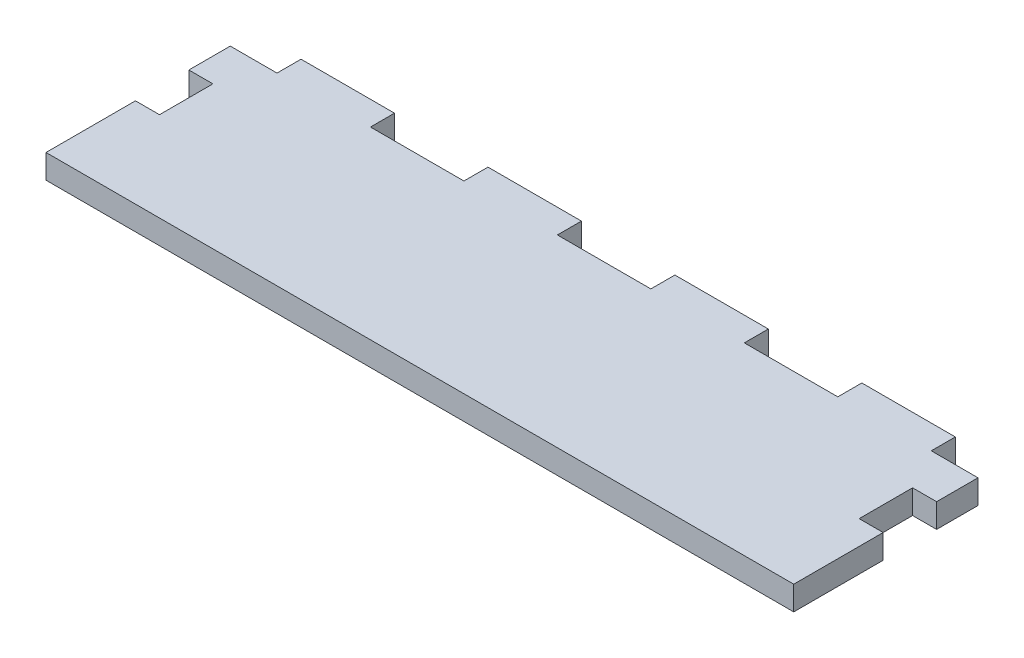
ISO-10303-21;
HEADER;
FILE_DESCRIPTION(('STEP AP214'),'2;1');
FILE_NAME('part.step','',(''),(''),'','','');
FILE_SCHEMA(('AUTOMOTIVE_DESIGN { 1 0 10303 214 1 1 1 1 }'));
ENDSEC;
DATA;
#1=APPLICATION_CONTEXT('core data for automotive mechanical design processes');
#2=APPLICATION_PROTOCOL_DEFINITION('international standard','automotive_design',2000,#1);
#3=PRODUCT_CONTEXT('',#1,'mechanical');
#4=PRODUCT('Part','Part','',(#3));
#5=PRODUCT_RELATED_PRODUCT_CATEGORY('part','',(#4));
#6=PRODUCT_DEFINITION_FORMATION('','',#4);
#7=PRODUCT_DEFINITION_CONTEXT('part definition',#1,'design');
#8=PRODUCT_DEFINITION('design','',#6,#7);
#9=PRODUCT_DEFINITION_SHAPE('','',#8);
#10=(LENGTH_UNIT() NAMED_UNIT(*) SI_UNIT(.MILLI.,.METRE.));
#11=(NAMED_UNIT(*) PLANE_ANGLE_UNIT() SI_UNIT($,.RADIAN.));
#12=(NAMED_UNIT(*) SI_UNIT($,.STERADIAN.) SOLID_ANGLE_UNIT());
#13=UNCERTAINTY_MEASURE_WITH_UNIT(LENGTH_MEASURE(1.E-05),#10,'distance_accuracy_value','');
#14=(GEOMETRIC_REPRESENTATION_CONTEXT(3) GLOBAL_UNCERTAINTY_ASSIGNED_CONTEXT((#13)) GLOBAL_UNIT_ASSIGNED_CONTEXT((#10,
#11,#12)) REPRESENTATION_CONTEXT('',''));
#15=CARTESIAN_POINT('',(0.,0.,0.));
#16=DIRECTION('',(0.,0.,1.));
#17=DIRECTION('',(1.,0.,0.));
#18=AXIS2_PLACEMENT_3D('',#15,#16,#17);
#19=CARTESIAN_POINT('',(140.,0.,349.144605516508));
#20=DIRECTION('',(-1.,0.,0.));
#21=DIRECTION('',(0.,0.,1.));
#22=AXIS2_PLACEMENT_3D('',#19,#20,#21);
#23=PLANE('',#22);
#24=DIRECTION('',(0.,0.,-1.));
#25=VECTOR('',#24,1.);
#26=CARTESIAN_POINT('',(140.,-75.,349.144605516508));
#27=LINE('',#26,#25);
#28=CARTESIAN_POINT('',(140.,-75.,78.));
#29=VERTEX_POINT('',#28);
#30=CARTESIAN_POINT('',(140.,-75.,44.5));
#31=VERTEX_POINT('',#30);
#32=EDGE_CURVE('E221',#29,#31,#27,.T.);
#33=ORIENTED_EDGE('',*,*,#32,.T.);
#34=DIRECTION('',(0.,-1.,0.));
#35=VECTOR('',#34,1.);
#36=CARTESIAN_POINT('',(140.,95.,44.5));
#37=LINE('',#36,#35);
#38=CARTESIAN_POINT('',(140.,-66.,44.5));
#39=VERTEX_POINT('',#38);
#40=EDGE_CURVE('E278',#39,#31,#37,.T.);
#41=ORIENTED_EDGE('',*,*,#40,.F.);
#42=DIRECTION('',(0.,0.,-1.));
#43=VECTOR('',#42,1.);
#44=CARTESIAN_POINT('',(140.,-66.,349.144605516508));
#45=LINE('',#44,#43);
#46=CARTESIAN_POINT('',(140.,-65.9999999999999,78.));
#47=VERTEX_POINT('',#46);
#48=EDGE_CURVE('E247',#47,#39,#45,.T.);
#49=ORIENTED_EDGE('',*,*,#48,.F.);
#50=DIRECTION('',(0.,-1.,0.));
#51=VECTOR('',#50,1.);
#52=CARTESIAN_POINT('',(140.,0.,78.));
#53=LINE('',#52,#51);
#54=EDGE_CURVE('E241',#47,#29,#53,.T.);
#55=ORIENTED_EDGE('',*,*,#54,.T.);
#56=EDGE_LOOP('',(#33,#41,#49,#55));
#57=FACE_BOUND('',#56,.T.);
#58=ADVANCED_FACE('F35',(#57),#23,.F.);
#59=CARTESIAN_POINT('',(-140.,0.,349.144605516508));
#60=DIRECTION('',(-1.,0.,0.));
#61=DIRECTION('',(0.,0.,1.));
#62=AXIS2_PLACEMENT_3D('',#59,#60,#61);
#63=PLANE('',#62);
#64=DIRECTION('',(0.,-1.,0.));
#65=VECTOR('',#64,1.);
#66=CARTESIAN_POINT('',(-140.,95.,24.5));
#67=LINE('',#66,#65);
#68=CARTESIAN_POINT('',(-140.,-66.,24.5));
#69=VERTEX_POINT('',#68);
#70=CARTESIAN_POINT('',(-140.,-75.,24.5));
#71=VERTEX_POINT('',#70);
#72=EDGE_CURVE('E267',#69,#71,#67,.T.);
#73=ORIENTED_EDGE('',*,*,#72,.F.);
#74=DIRECTION('',(0.,0.,-1.));
#75=VECTOR('',#74,1.);
#76=CARTESIAN_POINT('',(-140.,-66.,349.144605516508));
#77=LINE('',#76,#75);
#78=CARTESIAN_POINT('',(-140.,-66.,9.));
#79=VERTEX_POINT('',#78);
#80=EDGE_CURVE('E404',#69,#79,#77,.T.);
#81=ORIENTED_EDGE('',*,*,#80,.T.);
#82=DIRECTION('',(0.,1.,0.));
#83=VECTOR('',#82,1.);
#84=CARTESIAN_POINT('',(-140.,0.,9.));
#85=LINE('',#84,#83);
#86=CARTESIAN_POINT('',(-140.,-75.,9.));
#87=VERTEX_POINT('',#86);
#88=EDGE_CURVE('E388',#87,#79,#85,.T.);
#89=ORIENTED_EDGE('',*,*,#88,.F.);
#90=DIRECTION('',(0.,0.,-1.));
#91=VECTOR('',#90,1.);
#92=CARTESIAN_POINT('',(-140.,-75.,349.144605516508));
#93=LINE('',#92,#91);
#94=EDGE_CURVE('E233',#71,#87,#93,.T.);
#95=ORIENTED_EDGE('',*,*,#94,.F.);
#96=EDGE_LOOP('',(#73,#81,#89,#95));
#97=FACE_BOUND('',#96,.T.);
#98=ADVANCED_FACE('F492',(#97),#63,.T.);
#99=CARTESIAN_POINT('',(0.,0.,9.));
#100=DIRECTION('',(0.,0.,-1.));
#101=DIRECTION('',(-1.,0.,0.));
#102=AXIS2_PLACEMENT_3D('',#99,#100,#101);
#103=PLANE('',#102);
#104=DIRECTION('',(0.,-1.,0.));
#105=VECTOR('',#104,1.);
#106=CARTESIAN_POINT('',(87.5,0.,9.));
#107=LINE('',#106,#105);
#108=CARTESIAN_POINT('',(87.5,-66.,9.));
#109=VERTEX_POINT('',#108);
#110=CARTESIAN_POINT('',(87.5,-75.,9.));
#111=VERTEX_POINT('',#110);
#112=EDGE_CURVE('E285',#109,#111,#107,.T.);
#113=ORIENTED_EDGE('',*,*,#112,.T.);
#114=DIRECTION('',(-1.,0.,0.));
#115=VECTOR('',#114,1.);
#116=CARTESIAN_POINT('',(0.,-75.,9.));
#117=LINE('',#116,#115);
#118=CARTESIAN_POINT('',(52.5,-75.,9.));
#119=VERTEX_POINT('',#118);
#120=EDGE_CURVE('E397',#111,#119,#117,.T.);
#121=ORIENTED_EDGE('',*,*,#120,.T.);
#122=DIRECTION('',(0.,1.,0.));
#123=VECTOR('',#122,1.);
#124=CARTESIAN_POINT('',(52.5,0.,9.));
#125=LINE('',#124,#123);
#126=CARTESIAN_POINT('',(52.5,-66.,9.));
#127=VERTEX_POINT('',#126);
#128=EDGE_CURVE('E308',#119,#127,#125,.T.);
#129=ORIENTED_EDGE('',*,*,#128,.T.);
#130=DIRECTION('',(-1.,0.,0.));
#131=VECTOR('',#130,1.);
#132=CARTESIAN_POINT('',(0.,-66.,9.));
#133=LINE('',#132,#131);
#134=EDGE_CURVE('E389',#109,#127,#133,.T.);
#135=ORIENTED_EDGE('',*,*,#134,.F.);
#136=EDGE_LOOP('',(#113,#121,#129,#135));
#137=FACE_BOUND('',#136,.T.);
#138=ADVANCED_FACE('F472',(#137),#103,.T.);
#139=DIRECTION('',(0.,-1.,0.));
#140=VECTOR('',#139,1.);
#141=CARTESIAN_POINT('',(17.5,0.,9.));
#142=LINE('',#141,#140);
#143=CARTESIAN_POINT('',(17.5,-66.,9.));
#144=VERTEX_POINT('',#143);
#145=CARTESIAN_POINT('',(17.5,-75.,9.));
#146=VERTEX_POINT('',#145);
#147=EDGE_CURVE('E311',#144,#146,#142,.T.);
#148=ORIENTED_EDGE('',*,*,#147,.T.);
#149=CARTESIAN_POINT('',(-17.5,-75.,9.));
#150=VERTEX_POINT('',#149);
#151=EDGE_CURVE('E474',#146,#150,#117,.T.);
#152=ORIENTED_EDGE('',*,*,#151,.T.);
#153=DIRECTION('',(0.,-1.,0.));
#154=VECTOR('',#153,1.);
#155=CARTESIAN_POINT('',(-17.5,0.,9.));
#156=LINE('',#155,#154);
#157=CARTESIAN_POINT('',(-17.5,-66.,9.));
#158=VERTEX_POINT('',#157);
#159=EDGE_CURVE('E334',#158,#150,#156,.T.);
#160=ORIENTED_EDGE('',*,*,#159,.F.);
#161=EDGE_CURVE('E467',#144,#158,#133,.T.);
#162=ORIENTED_EDGE('',*,*,#161,.F.);
#163=EDGE_LOOP('',(#148,#152,#160,#162));
#164=FACE_BOUND('',#163,.T.);
#165=ADVANCED_FACE('F506',(#164),#103,.T.);
#166=CARTESIAN_POINT('',(-52.5,-66.,9.));
#167=VERTEX_POINT('',#166);
#168=CARTESIAN_POINT('',(-87.5,-66.,9.));
#169=VERTEX_POINT('',#168);
#170=EDGE_CURVE('E496',#167,#169,#133,.T.);
#171=ORIENTED_EDGE('',*,*,#170,.F.);
#172=DIRECTION('',(0.,1.,0.));
#173=VECTOR('',#172,1.);
#174=CARTESIAN_POINT('',(-52.5,0.,9.));
#175=LINE('',#174,#173);
#176=CARTESIAN_POINT('',(-52.5,-75.,9.));
#177=VERTEX_POINT('',#176);
#178=EDGE_CURVE('E338',#177,#167,#175,.T.);
#179=ORIENTED_EDGE('',*,*,#178,.F.);
#180=CARTESIAN_POINT('',(-87.5,-75.,9.));
#181=VERTEX_POINT('',#180);
#182=EDGE_CURVE('E475',#177,#181,#117,.T.);
#183=ORIENTED_EDGE('',*,*,#182,.T.);
#184=DIRECTION('',(0.,-1.,0.));
#185=VECTOR('',#184,1.);
#186=CARTESIAN_POINT('',(-87.5,0.,9.));
#187=LINE('',#186,#185);
#188=EDGE_CURVE('E359',#169,#181,#187,.T.);
#189=ORIENTED_EDGE('',*,*,#188,.F.);
#190=EDGE_LOOP('',(#171,#179,#183,#189));
#191=FACE_BOUND('',#190,.T.);
#192=ADVANCED_FACE('F508',(#191),#103,.T.);
#193=DIRECTION('',(0.,1.,0.));
#194=VECTOR('',#193,1.);
#195=CARTESIAN_POINT('',(122.5,1.88892111828586E-13,9.));
#196=LINE('',#195,#194);
#197=CARTESIAN_POINT('',(122.5,-75.,9.));
#198=VERTEX_POINT('',#197);
#199=CARTESIAN_POINT('',(122.5,-66.,9.));
#200=VERTEX_POINT('',#199);
#201=EDGE_CURVE('E282',#198,#200,#196,.T.);
#202=ORIENTED_EDGE('',*,*,#201,.T.);
#203=CARTESIAN_POINT('',(140.,-66.,9.));
#204=VERTEX_POINT('',#203);
#205=EDGE_CURVE('E385',#204,#200,#133,.T.);
#206=ORIENTED_EDGE('',*,*,#205,.F.);
#207=DIRECTION('',(0.,1.,0.));
#208=VECTOR('',#207,1.);
#209=CARTESIAN_POINT('',(140.,0.,9.));
#210=LINE('',#209,#208);
#211=CARTESIAN_POINT('',(140.,-75.,9.));
#212=VERTEX_POINT('',#211);
#213=EDGE_CURVE('E396',#212,#204,#210,.T.);
#214=ORIENTED_EDGE('',*,*,#213,.F.);
#215=EDGE_CURVE('E393',#212,#198,#117,.T.);
#216=ORIENTED_EDGE('',*,*,#215,.T.);
#217=EDGE_LOOP('',(#202,#206,#214,#216));
#218=FACE_BOUND('',#217,.T.);
#219=ADVANCED_FACE('F449',(#218),#103,.T.);
#220=DIRECTION('',(0.,1.,0.));
#221=VECTOR('',#220,1.);
#222=CARTESIAN_POINT('',(-122.5,0.,9.));
#223=LINE('',#222,#221);
#224=CARTESIAN_POINT('',(-122.5,-75.,9.));
#225=VERTEX_POINT('',#224);
#226=CARTESIAN_POINT('',(-122.5,-66.,9.));
#227=VERTEX_POINT('',#226);
#228=EDGE_CURVE('E363',#225,#227,#223,.T.);
#229=ORIENTED_EDGE('',*,*,#228,.F.);
#230=EDGE_CURVE('E392',#225,#87,#117,.T.);
#231=ORIENTED_EDGE('',*,*,#230,.T.);
#232=ORIENTED_EDGE('',*,*,#88,.T.);
#233=EDGE_CURVE('E362',#227,#79,#133,.T.);
#234=ORIENTED_EDGE('',*,*,#233,.F.);
#235=EDGE_LOOP('',(#229,#231,#232,#234));
#236=FACE_BOUND('',#235,.T.);
#237=ADVANCED_FACE('F489',(#236),#103,.T.);
#238=CARTESIAN_POINT('',(140.,-66.,24.5));
#239=VERTEX_POINT('',#238);
#240=EDGE_CURVE('E400',#239,#204,#45,.T.);
#241=ORIENTED_EDGE('',*,*,#240,.F.);
#242=DIRECTION('',(0.,-1.,0.));
#243=VECTOR('',#242,1.);
#244=CARTESIAN_POINT('',(140.,95.,24.5));
#245=LINE('',#244,#243);
#246=CARTESIAN_POINT('',(140.,-75.,24.5));
#247=VERTEX_POINT('',#246);
#248=EDGE_CURVE('E50',#239,#247,#245,.T.);
#249=ORIENTED_EDGE('',*,*,#248,.T.);
#250=EDGE_CURVE('E234',#247,#212,#27,.T.);
#251=ORIENTED_EDGE('',*,*,#250,.T.);
#252=ORIENTED_EDGE('',*,*,#213,.T.);
#253=EDGE_LOOP('',(#241,#249,#251,#252));
#254=FACE_BOUND('',#253,.T.);
#255=ADVANCED_FACE('F443',(#254),#23,.F.);
#256=CARTESIAN_POINT('',(0.,-75.,349.144605516508));
#257=DIRECTION('',(0.,-1.,0.));
#258=DIRECTION('',(0.,0.,-1.));
#259=AXIS2_PLACEMENT_3D('',#256,#257,#258);
#260=PLANE('',#259);
#261=DIRECTION('',(1.,0.,0.));
#262=VECTOR('',#261,1.);
#263=CARTESIAN_POINT('',(-131.,-75.,24.5));
#264=LINE('',#263,#262);
#265=CARTESIAN_POINT('',(-131.,-75.,24.5));
#266=VERTEX_POINT('',#265);
#267=EDGE_CURVE('E260',#71,#266,#264,.T.);
#268=ORIENTED_EDGE('',*,*,#267,.F.);
#269=ORIENTED_EDGE('',*,*,#94,.T.);
#270=ORIENTED_EDGE('',*,*,#230,.F.);
#271=DIRECTION('',(0.,0.,-1.));
#272=VECTOR('',#271,1.);
#273=CARTESIAN_POINT('',(-122.5,-75.,45.1386219991853));
#274=LINE('',#273,#272);
#275=CARTESIAN_POINT('',(-122.5,-75.,0.));
#276=VERTEX_POINT('',#275);
#277=EDGE_CURVE('E375',#225,#276,#274,.T.);
#278=ORIENTED_EDGE('',*,*,#277,.T.);
#279=DIRECTION('',(1.,0.,0.));
#280=VECTOR('',#279,1.);
#281=CARTESIAN_POINT('',(0.,-75.,0.));
#282=LINE('',#281,#280);
#283=CARTESIAN_POINT('',(-87.5,-75.,0.));
#284=VERTEX_POINT('',#283);
#285=EDGE_CURVE('E337',#276,#284,#282,.T.);
#286=ORIENTED_EDGE('',*,*,#285,.T.);
#287=DIRECTION('',(0.,0.,-1.));
#288=VECTOR('',#287,1.);
#289=CARTESIAN_POINT('',(-87.5,-75.,45.1386219991853));
#290=LINE('',#289,#288);
#291=EDGE_CURVE('E381',#181,#284,#290,.T.);
#292=ORIENTED_EDGE('',*,*,#291,.F.);
#293=ORIENTED_EDGE('',*,*,#182,.F.);
#294=DIRECTION('',(0.,0.,-1.));
#295=VECTOR('',#294,1.);
#296=CARTESIAN_POINT('',(-52.5,-75.,45.1386219991853));
#297=LINE('',#296,#295);
#298=CARTESIAN_POINT('',(-52.5,-75.,0.));
#299=VERTEX_POINT('',#298);
#300=EDGE_CURVE('E350',#177,#299,#297,.T.);
#301=ORIENTED_EDGE('',*,*,#300,.T.);
#302=DIRECTION('',(1.,0.,0.));
#303=VECTOR('',#302,1.);
#304=CARTESIAN_POINT('',(0.,-75.,0.));
#305=LINE('',#304,#303);
#306=CARTESIAN_POINT('',(-17.5,-75.,0.));
#307=VERTEX_POINT('',#306);
#308=EDGE_CURVE('E315',#299,#307,#305,.T.);
#309=ORIENTED_EDGE('',*,*,#308,.T.);
#310=DIRECTION('',(0.,0.,-1.));
#311=VECTOR('',#310,1.);
#312=CARTESIAN_POINT('',(-17.5,-75.,45.1386219991853));
#313=LINE('',#312,#311);
#314=EDGE_CURVE('E356',#150,#307,#313,.T.);
#315=ORIENTED_EDGE('',*,*,#314,.F.);
#316=ORIENTED_EDGE('',*,*,#151,.F.);
#317=DIRECTION('',(0.,0.,-1.));
#318=VECTOR('',#317,1.);
#319=CARTESIAN_POINT('',(17.5,-75.,45.1386219991853));
#320=LINE('',#319,#318);
#321=CARTESIAN_POINT('',(17.5,-75.,0.));
#322=VERTEX_POINT('',#321);
#323=EDGE_CURVE('E312',#146,#322,#320,.T.);
#324=ORIENTED_EDGE('',*,*,#323,.T.);
#325=DIRECTION('',(1.,0.,0.));
#326=VECTOR('',#325,1.);
#327=CARTESIAN_POINT('',(0.,-75.,0.));
#328=LINE('',#327,#326);
#329=CARTESIAN_POINT('',(52.5,-75.,0.));
#330=VERTEX_POINT('',#329);
#331=EDGE_CURVE('E318',#322,#330,#328,.T.);
#332=ORIENTED_EDGE('',*,*,#331,.T.);
#333=DIRECTION('',(0.,0.,-1.));
#334=VECTOR('',#333,1.);
#335=CARTESIAN_POINT('',(52.5,-75.,45.1386219991853));
#336=LINE('',#335,#334);
#337=EDGE_CURVE('E331',#119,#330,#336,.T.);
#338=ORIENTED_EDGE('',*,*,#337,.F.);
#339=ORIENTED_EDGE('',*,*,#120,.F.);
#340=DIRECTION('',(0.,0.,-1.));
#341=VECTOR('',#340,1.);
#342=CARTESIAN_POINT('',(87.5,-75.,45.1386219991853));
#343=LINE('',#342,#341);
#344=CARTESIAN_POINT('',(87.5,-75.,0.));
#345=VERTEX_POINT('',#344);
#346=EDGE_CURVE('E286',#111,#345,#343,.T.);
#347=ORIENTED_EDGE('',*,*,#346,.T.);
#348=DIRECTION('',(1.,0.,0.));
#349=VECTOR('',#348,1.);
#350=CARTESIAN_POINT('',(0.,-75.,0.));
#351=LINE('',#350,#349);
#352=CARTESIAN_POINT('',(122.5,-75.,0.));
#353=VERTEX_POINT('',#352);
#354=EDGE_CURVE('E292',#345,#353,#351,.T.);
#355=ORIENTED_EDGE('',*,*,#354,.T.);
#356=DIRECTION('',(0.,0.,-1.));
#357=VECTOR('',#356,1.);
#358=CARTESIAN_POINT('',(122.5,-75.,45.1386219991853));
#359=LINE('',#358,#357);
#360=EDGE_CURVE('E305',#198,#353,#359,.T.);
#361=ORIENTED_EDGE('',*,*,#360,.F.);
#362=ORIENTED_EDGE('',*,*,#215,.F.);
#363=ORIENTED_EDGE('',*,*,#250,.F.);
#364=DIRECTION('',(1.,0.,0.));
#365=VECTOR('',#364,1.);
#366=CARTESIAN_POINT('',(131.,-75.,24.5));
#367=LINE('',#366,#365);
#368=CARTESIAN_POINT('',(131.,-75.,24.5));
#369=VERTEX_POINT('',#368);
#370=EDGE_CURVE('E273',#369,#247,#367,.T.);
#371=ORIENTED_EDGE('',*,*,#370,.F.);
#372=DIRECTION('',(0.,0.,-1.));
#373=VECTOR('',#372,1.);
#374=CARTESIAN_POINT('',(131.,-75.,44.5));
#375=LINE('',#374,#373);
#376=CARTESIAN_POINT('',(131.,-75.,44.5));
#377=VERTEX_POINT('',#376);
#378=EDGE_CURVE('E253',#377,#369,#375,.T.);
#379=ORIENTED_EDGE('',*,*,#378,.F.);
#380=DIRECTION('',(-1.,0.,0.));
#381=VECTOR('',#380,1.);
#382=CARTESIAN_POINT('',(131.,-75.,44.5));
#383=LINE('',#382,#381);
#384=EDGE_CURVE('E229',#31,#377,#383,.T.);
#385=ORIENTED_EDGE('',*,*,#384,.F.);
#386=ORIENTED_EDGE('',*,*,#32,.F.);
#387=DIRECTION('',(1.,0.,0.));
#388=VECTOR('',#387,1.);
#389=CARTESIAN_POINT('',(0.,-75.,78.));
#390=LINE('',#389,#388);
#391=CARTESIAN_POINT('',(-140.,-75.,78.));
#392=VERTEX_POINT('',#391);
#393=EDGE_CURVE('E226',#392,#29,#390,.T.);
#394=ORIENTED_EDGE('',*,*,#393,.F.);
#395=CARTESIAN_POINT('',(-140.,-75.,44.5));
#396=VERTEX_POINT('',#395);
#397=EDGE_CURVE('E402',#392,#396,#93,.T.);
#398=ORIENTED_EDGE('',*,*,#397,.T.);
#399=DIRECTION('',(-1.,0.,0.));
#400=VECTOR('',#399,1.);
#401=CARTESIAN_POINT('',(-131.,-75.,44.5));
#402=LINE('',#401,#400);
#403=CARTESIAN_POINT('',(-131.,-75.,44.5));
#404=VERTEX_POINT('',#403);
#405=EDGE_CURVE('E257',#404,#396,#402,.T.);
#406=ORIENTED_EDGE('',*,*,#405,.F.);
#407=DIRECTION('',(0.,0.,1.));
#408=VECTOR('',#407,1.);
#409=CARTESIAN_POINT('',(-131.,-75.,44.5));
#410=LINE('',#409,#408);
#411=EDGE_CURVE('E254',#266,#404,#410,.T.);
#412=ORIENTED_EDGE('',*,*,#411,.F.);
#413=EDGE_LOOP('',(#268,#269,#270,#278,#286,#292,#293,#301,#309,#315,#316,#324,#332,#338,#339,
#347,#355,#361,#362,#363,#371,#379,#385,#386,#394,#398,#406,#412));
#414=FACE_BOUND('',#413,.T.);
#415=ADVANCED_FACE('F224',(#414),#260,.T.);
#416=DIRECTION('',(0.,-1.,0.));
#417=VECTOR('',#416,1.);
#418=CARTESIAN_POINT('',(-140.,95.,44.5));
#419=LINE('',#418,#417);
#420=CARTESIAN_POINT('',(-140.,-66.,44.5));
#421=VERTEX_POINT('',#420);
#422=EDGE_CURVE('E58',#421,#396,#419,.T.);
#423=ORIENTED_EDGE('',*,*,#422,.T.);
#424=ORIENTED_EDGE('',*,*,#397,.F.);
#425=DIRECTION('',(0.,-1.,0.));
#426=VECTOR('',#425,1.);
#427=CARTESIAN_POINT('',(-140.,0.,78.));
#428=LINE('',#427,#426);
#429=CARTESIAN_POINT('',(-140.,-66.0000000000017,78.));
#430=VERTEX_POINT('',#429);
#431=EDGE_CURVE('E244',#430,#392,#428,.T.);
#432=ORIENTED_EDGE('',*,*,#431,.F.);
#433=EDGE_CURVE('E405',#430,#421,#77,.T.);
#434=ORIENTED_EDGE('',*,*,#433,.T.);
#435=EDGE_LOOP('',(#423,#424,#432,#434));
#436=FACE_BOUND('',#435,.T.);
#437=ADVANCED_FACE('F432',(#436),#63,.T.);
#438=CARTESIAN_POINT('',(0.,-66.,349.144605516508));
#439=DIRECTION('',(0.,-1.,0.));
#440=DIRECTION('',(0.,0.,-1.));
#441=AXIS2_PLACEMENT_3D('',#438,#439,#440);
#442=PLANE('',#441);
#443=ORIENTED_EDGE('',*,*,#80,.F.);
#444=DIRECTION('',(1.,0.,0.));
#445=VECTOR('',#444,1.);
#446=CARTESIAN_POINT('',(0.,-66.,24.5));
#447=LINE('',#446,#445);
#448=CARTESIAN_POINT('',(-131.,-66.,24.5));
#449=VERTEX_POINT('',#448);
#450=EDGE_CURVE('E11',#69,#449,#447,.T.);
#451=ORIENTED_EDGE('',*,*,#450,.T.);
#452=DIRECTION('',(0.,0.,1.));
#453=VECTOR('',#452,1.);
#454=CARTESIAN_POINT('',(-131.,-66.,349.144605516508));
#455=LINE('',#454,#453);
#456=CARTESIAN_POINT('',(-131.,-66.,44.5));
#457=VERTEX_POINT('',#456);
#458=EDGE_CURVE('E43',#449,#457,#455,.T.);
#459=ORIENTED_EDGE('',*,*,#458,.T.);
#460=DIRECTION('',(-1.,0.,0.));
#461=VECTOR('',#460,1.);
#462=CARTESIAN_POINT('',(0.,-66.,44.5));
#463=LINE('',#462,#461);
#464=EDGE_CURVE('E416',#457,#421,#463,.T.);
#465=ORIENTED_EDGE('',*,*,#464,.T.);
#466=ORIENTED_EDGE('',*,*,#433,.F.);
#467=DIRECTION('',(1.,0.,0.));
#468=VECTOR('',#467,1.);
#469=CARTESIAN_POINT('',(4.07081775695898E-13,-66.0000000000008,78.));
#470=LINE('',#469,#468);
#471=EDGE_CURVE('E248',#430,#47,#470,.T.);
#472=ORIENTED_EDGE('',*,*,#471,.T.);
#473=ORIENTED_EDGE('',*,*,#48,.T.);
#474=DIRECTION('',(-1.,0.,0.));
#475=VECTOR('',#474,1.);
#476=CARTESIAN_POINT('',(0.,-66.,44.5));
#477=LINE('',#476,#475);
#478=CARTESIAN_POINT('',(131.,-66.,44.5));
#479=VERTEX_POINT('',#478);
#480=EDGE_CURVE('E413',#39,#479,#477,.T.);
#481=ORIENTED_EDGE('',*,*,#480,.T.);
#482=DIRECTION('',(0.,0.,-1.));
#483=VECTOR('',#482,1.);
#484=CARTESIAN_POINT('',(131.,-66.,349.144605516508));
#485=LINE('',#484,#483);
#486=CARTESIAN_POINT('',(131.,-66.,24.5));
#487=VERTEX_POINT('',#486);
#488=EDGE_CURVE('E410',#479,#487,#485,.T.);
#489=ORIENTED_EDGE('',*,*,#488,.T.);
#490=DIRECTION('',(1.,0.,0.));
#491=VECTOR('',#490,1.);
#492=CARTESIAN_POINT('',(0.,-66.,24.5));
#493=LINE('',#492,#491);
#494=EDGE_CURVE('E408',#487,#239,#493,.T.);
#495=ORIENTED_EDGE('',*,*,#494,.T.);
#496=ORIENTED_EDGE('',*,*,#240,.T.);
#497=ORIENTED_EDGE('',*,*,#205,.T.);
#498=DIRECTION('',(0.,0.,-1.));
#499=VECTOR('',#498,1.);
#500=CARTESIAN_POINT('',(122.5,-66.,45.1386219991853));
#501=LINE('',#500,#499);
#502=CARTESIAN_POINT('',(122.5,-66.,0.));
#503=VERTEX_POINT('',#502);
#504=EDGE_CURVE('E303',#200,#503,#501,.T.);
#505=ORIENTED_EDGE('',*,*,#504,.T.);
#506=DIRECTION('',(1.,0.,0.));
#507=VECTOR('',#506,1.);
#508=CARTESIAN_POINT('',(0.,-66.,0.));
#509=LINE('',#508,#507);
#510=CARTESIAN_POINT('',(87.5,-66.,0.));
#511=VERTEX_POINT('',#510);
#512=EDGE_CURVE('E298',#511,#503,#509,.T.);
#513=ORIENTED_EDGE('',*,*,#512,.F.);
#514=DIRECTION('',(0.,0.,-1.));
#515=VECTOR('',#514,1.);
#516=CARTESIAN_POINT('',(87.5,-66.,45.1386219991853));
#517=LINE('',#516,#515);
#518=EDGE_CURVE('E301',#109,#511,#517,.T.);
#519=ORIENTED_EDGE('',*,*,#518,.F.);
#520=ORIENTED_EDGE('',*,*,#134,.T.);
#521=DIRECTION('',(0.,0.,-1.));
#522=VECTOR('',#521,1.);
#523=CARTESIAN_POINT('',(52.5,-66.,45.1386219991853));
#524=LINE('',#523,#522);
#525=CARTESIAN_POINT('',(52.5,-66.,0.));
#526=VERTEX_POINT('',#525);
#527=EDGE_CURVE('E329',#127,#526,#524,.T.);
#528=ORIENTED_EDGE('',*,*,#527,.T.);
#529=DIRECTION('',(1.,0.,0.));
#530=VECTOR('',#529,1.);
#531=CARTESIAN_POINT('',(0.,-66.,0.));
#532=LINE('',#531,#530);
#533=CARTESIAN_POINT('',(17.5,-66.,0.));
#534=VERTEX_POINT('',#533);
#535=EDGE_CURVE('E324',#534,#526,#532,.T.);
#536=ORIENTED_EDGE('',*,*,#535,.F.);
#537=DIRECTION('',(0.,0.,-1.));
#538=VECTOR('',#537,1.);
#539=CARTESIAN_POINT('',(17.5,-66.,45.1386219991853));
#540=LINE('',#539,#538);
#541=EDGE_CURVE('E327',#144,#534,#540,.T.);
#542=ORIENTED_EDGE('',*,*,#541,.F.);
#543=ORIENTED_EDGE('',*,*,#161,.T.);
#544=DIRECTION('',(0.,0.,-1.));
#545=VECTOR('',#544,1.);
#546=CARTESIAN_POINT('',(-17.5,-66.,45.1386219991853));
#547=LINE('',#546,#545);
#548=CARTESIAN_POINT('',(-17.5,-66.,0.));
#549=VERTEX_POINT('',#548);
#550=EDGE_CURVE('E354',#158,#549,#547,.T.);
#551=ORIENTED_EDGE('',*,*,#550,.T.);
#552=DIRECTION('',(1.,0.,0.));
#553=VECTOR('',#552,1.);
#554=CARTESIAN_POINT('',(0.,-66.,0.));
#555=LINE('',#554,#553);
#556=CARTESIAN_POINT('',(-52.5,-66.,0.));
#557=VERTEX_POINT('',#556);
#558=EDGE_CURVE('E344',#557,#549,#555,.T.);
#559=ORIENTED_EDGE('',*,*,#558,.F.);
#560=DIRECTION('',(0.,0.,-1.));
#561=VECTOR('',#560,1.);
#562=CARTESIAN_POINT('',(-52.5,-66.,45.1386219991853));
#563=LINE('',#562,#561);
#564=EDGE_CURVE('E352',#167,#557,#563,.T.);
#565=ORIENTED_EDGE('',*,*,#564,.F.);
#566=ORIENTED_EDGE('',*,*,#170,.T.);
#567=DIRECTION('',(0.,0.,-1.));
#568=VECTOR('',#567,1.);
#569=CARTESIAN_POINT('',(-87.5,-66.,45.1386219991853));
#570=LINE('',#569,#568);
#571=CARTESIAN_POINT('',(-87.5,-66.,0.));
#572=VERTEX_POINT('',#571);
#573=EDGE_CURVE('E379',#169,#572,#570,.T.);
#574=ORIENTED_EDGE('',*,*,#573,.T.);
#575=DIRECTION('',(1.,0.,0.));
#576=VECTOR('',#575,1.);
#577=CARTESIAN_POINT('',(0.,-66.,0.));
#578=LINE('',#577,#576);
#579=CARTESIAN_POINT('',(-122.5,-66.,0.));
#580=VERTEX_POINT('',#579);
#581=EDGE_CURVE('E369',#580,#572,#578,.T.);
#582=ORIENTED_EDGE('',*,*,#581,.F.);
#583=DIRECTION('',(0.,0.,-1.));
#584=VECTOR('',#583,1.);
#585=CARTESIAN_POINT('',(-122.5,-66.,45.1386219991853));
#586=LINE('',#585,#584);
#587=EDGE_CURVE('E377',#227,#580,#586,.T.);
#588=ORIENTED_EDGE('',*,*,#587,.F.);
#589=ORIENTED_EDGE('',*,*,#233,.T.);
#590=EDGE_LOOP('',(#443,#451,#459,#465,#466,#472,#473,#481,#489,#495,#496,#497,#505,#513,#519,
#520,#528,#536,#542,#543,#551,#559,#565,#566,#574,#582,#588,#589));
#591=FACE_BOUND('',#590,.T.);
#592=ADVANCED_FACE('F37',(#591),#442,.F.);
#593=CARTESIAN_POINT('',(0.,0.,0.));
#594=DIRECTION('',(0.,0.,1.));
#595=DIRECTION('',(1.,0.,0.));
#596=AXIS2_PLACEMENT_3D('',#593,#594,#595);
#597=PLANE('',#596);
#598=ORIENTED_EDGE('',*,*,#285,.F.);
#599=DIRECTION('',(0.,-1.,0.));
#600=VECTOR('',#599,1.);
#601=CARTESIAN_POINT('',(-122.5,0.,0.));
#602=LINE('',#601,#600);
#603=EDGE_CURVE('E372',#580,#276,#602,.T.);
#604=ORIENTED_EDGE('',*,*,#603,.F.);
#605=ORIENTED_EDGE('',*,*,#581,.T.);
#606=DIRECTION('',(0.,1.,0.));
#607=VECTOR('',#606,1.);
#608=CARTESIAN_POINT('',(-87.5,0.,0.));
#609=LINE('',#608,#607);
#610=EDGE_CURVE('E366',#284,#572,#609,.T.);
#611=ORIENTED_EDGE('',*,*,#610,.F.);
#612=EDGE_LOOP('',(#598,#604,#605,#611));
#613=FACE_BOUND('',#612,.T.);
#614=ADVANCED_FACE('F706',(#613),#597,.F.);
#615=CARTESIAN_POINT('',(-122.5,0.,45.1386219991853));
#616=DIRECTION('',(1.,0.,0.));
#617=DIRECTION('',(0.,0.,-1.));
#618=AXIS2_PLACEMENT_3D('',#615,#616,#617);
#619=PLANE('',#618);
#620=ORIENTED_EDGE('',*,*,#277,.F.);
#621=ORIENTED_EDGE('',*,*,#228,.T.);
#622=ORIENTED_EDGE('',*,*,#587,.T.);
#623=ORIENTED_EDGE('',*,*,#603,.T.);
#624=EDGE_LOOP('',(#620,#621,#622,#623));
#625=FACE_BOUND('',#624,.T.);
#626=ADVANCED_FACE('F721',(#625),#619,.F.);
#627=CARTESIAN_POINT('',(-87.5,0.,45.1386219991853));
#628=DIRECTION('',(-1.,0.,0.));
#629=DIRECTION('',(0.,0.,1.));
#630=AXIS2_PLACEMENT_3D('',#627,#628,#629);
#631=PLANE('',#630);
#632=ORIENTED_EDGE('',*,*,#573,.F.);
#633=ORIENTED_EDGE('',*,*,#188,.T.);
#634=ORIENTED_EDGE('',*,*,#291,.T.);
#635=ORIENTED_EDGE('',*,*,#610,.T.);
#636=EDGE_LOOP('',(#632,#633,#634,#635));
#637=FACE_BOUND('',#636,.T.);
#638=ADVANCED_FACE('F584',(#637),#631,.F.);
#639=CARTESIAN_POINT('',(0.,0.,0.));
#640=DIRECTION('',(0.,0.,1.));
#641=DIRECTION('',(1.,0.,0.));
#642=AXIS2_PLACEMENT_3D('',#639,#640,#641);
#643=PLANE('',#642);
#644=ORIENTED_EDGE('',*,*,#308,.F.);
#645=DIRECTION('',(0.,-1.,0.));
#646=VECTOR('',#645,1.);
#647=CARTESIAN_POINT('',(-52.5,0.,0.));
#648=LINE('',#647,#646);
#649=EDGE_CURVE('E347',#557,#299,#648,.T.);
#650=ORIENTED_EDGE('',*,*,#649,.F.);
#651=ORIENTED_EDGE('',*,*,#558,.T.);
#652=DIRECTION('',(0.,1.,0.));
#653=VECTOR('',#652,1.);
#654=CARTESIAN_POINT('',(-17.5,0.,0.));
#655=LINE('',#654,#653);
#656=EDGE_CURVE('E341',#307,#549,#655,.T.);
#657=ORIENTED_EDGE('',*,*,#656,.F.);
#658=EDGE_LOOP('',(#644,#650,#651,#657));
#659=FACE_BOUND('',#658,.T.);
#660=ADVANCED_FACE('F578',(#659),#643,.F.);
#661=CARTESIAN_POINT('',(-52.5,0.,45.1386219991853));
#662=DIRECTION('',(1.,0.,0.));
#663=DIRECTION('',(0.,0.,-1.));
#664=AXIS2_PLACEMENT_3D('',#661,#662,#663);
#665=PLANE('',#664);
#666=ORIENTED_EDGE('',*,*,#300,.F.);
#667=ORIENTED_EDGE('',*,*,#178,.T.);
#668=ORIENTED_EDGE('',*,*,#564,.T.);
#669=ORIENTED_EDGE('',*,*,#649,.T.);
#670=EDGE_LOOP('',(#666,#667,#668,#669));
#671=FACE_BOUND('',#670,.T.);
#672=ADVANCED_FACE('F583',(#671),#665,.F.);
#673=CARTESIAN_POINT('',(-17.5,0.,45.1386219991853));
#674=DIRECTION('',(-1.,0.,0.));
#675=DIRECTION('',(0.,0.,1.));
#676=AXIS2_PLACEMENT_3D('',#673,#674,#675);
#677=PLANE('',#676);
#678=ORIENTED_EDGE('',*,*,#550,.F.);
#679=ORIENTED_EDGE('',*,*,#159,.T.);
#680=ORIENTED_EDGE('',*,*,#314,.T.);
#681=ORIENTED_EDGE('',*,*,#656,.T.);
#682=EDGE_LOOP('',(#678,#679,#680,#681));
#683=FACE_BOUND('',#682,.T.);
#684=ADVANCED_FACE('F504',(#683),#677,.F.);
#685=CARTESIAN_POINT('',(17.5,0.,45.1386219991853));
#686=DIRECTION('',(-1.,0.,0.));
#687=DIRECTION('',(0.,0.,1.));
#688=AXIS2_PLACEMENT_3D('',#685,#686,#687);
#689=PLANE('',#688);
#690=ORIENTED_EDGE('',*,*,#147,.F.);
#691=ORIENTED_EDGE('',*,*,#541,.T.);
#692=DIRECTION('',(0.,1.,0.));
#693=VECTOR('',#692,1.);
#694=CARTESIAN_POINT('',(17.5,0.,0.));
#695=LINE('',#694,#693);
#696=EDGE_CURVE('E289',#322,#534,#695,.T.);
#697=ORIENTED_EDGE('',*,*,#696,.F.);
#698=ORIENTED_EDGE('',*,*,#323,.F.);
#699=EDGE_LOOP('',(#690,#691,#697,#698));
#700=FACE_BOUND('',#699,.T.);
#701=ADVANCED_FACE('F602',(#700),#689,.T.);
#702=CARTESIAN_POINT('',(52.5,0.,45.1386219991853));
#703=DIRECTION('',(1.,0.,0.));
#704=DIRECTION('',(0.,0.,-1.));
#705=AXIS2_PLACEMENT_3D('',#702,#703,#704);
#706=PLANE('',#705);
#707=ORIENTED_EDGE('',*,*,#128,.F.);
#708=ORIENTED_EDGE('',*,*,#337,.T.);
#709=DIRECTION('',(0.,-1.,0.));
#710=VECTOR('',#709,1.);
#711=CARTESIAN_POINT('',(52.5,0.,0.));
#712=LINE('',#711,#710);
#713=EDGE_CURVE('E321',#526,#330,#712,.T.);
#714=ORIENTED_EDGE('',*,*,#713,.F.);
#715=ORIENTED_EDGE('',*,*,#527,.F.);
#716=EDGE_LOOP('',(#707,#708,#714,#715));
#717=FACE_BOUND('',#716,.T.);
#718=ADVANCED_FACE('F470',(#717),#706,.T.);
#719=CARTESIAN_POINT('',(0.,0.,0.));
#720=DIRECTION('',(0.,0.,1.));
#721=DIRECTION('',(1.,0.,0.));
#722=AXIS2_PLACEMENT_3D('',#719,#720,#721);
#723=PLANE('',#722);
#724=ORIENTED_EDGE('',*,*,#696,.T.);
#725=ORIENTED_EDGE('',*,*,#535,.T.);
#726=ORIENTED_EDGE('',*,*,#713,.T.);
#727=ORIENTED_EDGE('',*,*,#331,.F.);
#728=EDGE_LOOP('',(#724,#725,#726,#727));
#729=FACE_BOUND('',#728,.T.);
#730=ADVANCED_FACE('F618',(#729),#723,.F.);
#731=CARTESIAN_POINT('',(87.5,0.,45.1386219991853));
#732=DIRECTION('',(-1.,0.,0.));
#733=DIRECTION('',(0.,0.,1.));
#734=AXIS2_PLACEMENT_3D('',#731,#732,#733);
#735=PLANE('',#734);
#736=ORIENTED_EDGE('',*,*,#112,.F.);
#737=ORIENTED_EDGE('',*,*,#518,.T.);
#738=DIRECTION('',(0.,1.,0.));
#739=VECTOR('',#738,1.);
#740=CARTESIAN_POINT('',(87.5,0.,0.));
#741=LINE('',#740,#739);
#742=EDGE_CURVE('E266',#345,#511,#741,.T.);
#743=ORIENTED_EDGE('',*,*,#742,.F.);
#744=ORIENTED_EDGE('',*,*,#346,.F.);
#745=EDGE_LOOP('',(#736,#737,#743,#744));
#746=FACE_BOUND('',#745,.T.);
#747=ADVANCED_FACE('F461',(#746),#735,.T.);
#748=CARTESIAN_POINT('',(122.5,1.88892111828586E-13,45.1386219991853));
#749=DIRECTION('',(1.,0.,0.));
#750=DIRECTION('',(0.,1.,0.));
#751=AXIS2_PLACEMENT_3D('',#748,#749,#750);
#752=PLANE('',#751);
#753=ORIENTED_EDGE('',*,*,#201,.F.);
#754=ORIENTED_EDGE('',*,*,#360,.T.);
#755=DIRECTION('',(0.,-1.,0.));
#756=VECTOR('',#755,1.);
#757=CARTESIAN_POINT('',(122.5,1.88892111828586E-13,0.));
#758=LINE('',#757,#756);
#759=EDGE_CURVE('E295',#503,#353,#758,.T.);
#760=ORIENTED_EDGE('',*,*,#759,.F.);
#761=ORIENTED_EDGE('',*,*,#504,.F.);
#762=EDGE_LOOP('',(#753,#754,#760,#761));
#763=FACE_BOUND('',#762,.T.);
#764=ADVANCED_FACE('F453',(#763),#752,.T.);
#765=CARTESIAN_POINT('',(0.,0.,0.));
#766=DIRECTION('',(0.,0.,1.));
#767=DIRECTION('',(1.,0.,0.));
#768=AXIS2_PLACEMENT_3D('',#765,#766,#767);
#769=PLANE('',#768);
#770=ORIENTED_EDGE('',*,*,#742,.T.);
#771=ORIENTED_EDGE('',*,*,#512,.T.);
#772=ORIENTED_EDGE('',*,*,#759,.T.);
#773=ORIENTED_EDGE('',*,*,#354,.F.);
#774=EDGE_LOOP('',(#770,#771,#772,#773));
#775=FACE_BOUND('',#774,.T.);
#776=ADVANCED_FACE('F457',(#775),#769,.F.);
#777=CARTESIAN_POINT('',(131.,95.,44.5));
#778=DIRECTION('',(-1.,0.,0.));
#779=DIRECTION('',(0.,0.,1.));
#780=AXIS2_PLACEMENT_3D('',#777,#778,#779);
#781=PLANE('',#780);
#782=DIRECTION('',(0.,-1.,0.));
#783=VECTOR('',#782,1.);
#784=CARTESIAN_POINT('',(131.,95.,44.5));
#785=LINE('',#784,#783);
#786=EDGE_CURVE('E258',#479,#377,#785,.T.);
#787=ORIENTED_EDGE('',*,*,#786,.T.);
#788=ORIENTED_EDGE('',*,*,#378,.T.);
#789=DIRECTION('',(0.,-1.,0.));
#790=VECTOR('',#789,1.);
#791=CARTESIAN_POINT('',(131.,95.,24.5));
#792=LINE('',#791,#790);
#793=EDGE_CURVE('E276',#487,#369,#792,.T.);
#794=ORIENTED_EDGE('',*,*,#793,.F.);
#795=ORIENTED_EDGE('',*,*,#488,.F.);
#796=EDGE_LOOP('',(#787,#788,#794,#795));
#797=FACE_BOUND('',#796,.T.);
#798=ADVANCED_FACE('F437',(#797),#781,.F.);
#799=CARTESIAN_POINT('',(131.,95.,44.5));
#800=DIRECTION('',(0.,0.,1.));
#801=DIRECTION('',(1.,0.,0.));
#802=AXIS2_PLACEMENT_3D('',#799,#800,#801);
#803=PLANE('',#802);
#804=ORIENTED_EDGE('',*,*,#40,.T.);
#805=ORIENTED_EDGE('',*,*,#384,.T.);
#806=ORIENTED_EDGE('',*,*,#786,.F.);
#807=ORIENTED_EDGE('',*,*,#480,.F.);
#808=EDGE_LOOP('',(#804,#805,#806,#807));
#809=FACE_BOUND('',#808,.T.);
#810=ADVANCED_FACE('F435',(#809),#803,.F.);
#811=CARTESIAN_POINT('',(131.,95.,24.5));
#812=DIRECTION('',(0.,0.,-1.));
#813=DIRECTION('',(-1.,0.,0.));
#814=AXIS2_PLACEMENT_3D('',#811,#812,#813);
#815=PLANE('',#814);
#816=ORIENTED_EDGE('',*,*,#793,.T.);
#817=ORIENTED_EDGE('',*,*,#370,.T.);
#818=ORIENTED_EDGE('',*,*,#248,.F.);
#819=ORIENTED_EDGE('',*,*,#494,.F.);
#820=EDGE_LOOP('',(#816,#817,#818,#819));
#821=FACE_BOUND('',#820,.T.);
#822=ADVANCED_FACE('F440',(#821),#815,.F.);
#823=CARTESIAN_POINT('',(-131.,95.,44.5));
#824=DIRECTION('',(1.,0.,0.));
#825=DIRECTION('',(0.,0.,-1.));
#826=AXIS2_PLACEMENT_3D('',#823,#824,#825);
#827=PLANE('',#826);
#828=DIRECTION('',(0.,-1.,0.));
#829=VECTOR('',#828,1.);
#830=CARTESIAN_POINT('',(-131.,95.,24.5));
#831=LINE('',#830,#829);
#832=EDGE_CURVE('E264',#449,#266,#831,.T.);
#833=ORIENTED_EDGE('',*,*,#832,.T.);
#834=ORIENTED_EDGE('',*,*,#411,.T.);
#835=DIRECTION('',(0.,-1.,0.));
#836=VECTOR('',#835,1.);
#837=CARTESIAN_POINT('',(-131.,95.,44.5));
#838=LINE('',#837,#836);
#839=EDGE_CURVE('E263',#457,#404,#838,.T.);
#840=ORIENTED_EDGE('',*,*,#839,.F.);
#841=ORIENTED_EDGE('',*,*,#458,.F.);
#842=EDGE_LOOP('',(#833,#834,#840,#841));
#843=FACE_BOUND('',#842,.T.);
#844=ADVANCED_FACE('F423',(#843),#827,.F.);
#845=CARTESIAN_POINT('',(-131.,95.,24.5));
#846=DIRECTION('',(0.,0.,-1.));
#847=DIRECTION('',(-1.,0.,0.));
#848=AXIS2_PLACEMENT_3D('',#845,#846,#847);
#849=PLANE('',#848);
#850=ORIENTED_EDGE('',*,*,#72,.T.);
#851=ORIENTED_EDGE('',*,*,#267,.T.);
#852=ORIENTED_EDGE('',*,*,#832,.F.);
#853=ORIENTED_EDGE('',*,*,#450,.F.);
#854=EDGE_LOOP('',(#850,#851,#852,#853));
#855=FACE_BOUND('',#854,.T.);
#856=ADVANCED_FACE('F425',(#855),#849,.F.);
#857=CARTESIAN_POINT('',(-131.,95.,44.5));
#858=DIRECTION('',(0.,0.,1.));
#859=DIRECTION('',(1.,0.,0.));
#860=AXIS2_PLACEMENT_3D('',#857,#858,#859);
#861=PLANE('',#860);
#862=ORIENTED_EDGE('',*,*,#839,.T.);
#863=ORIENTED_EDGE('',*,*,#405,.T.);
#864=ORIENTED_EDGE('',*,*,#422,.F.);
#865=ORIENTED_EDGE('',*,*,#464,.F.);
#866=EDGE_LOOP('',(#862,#863,#864,#865));
#867=FACE_BOUND('',#866,.T.);
#868=ADVANCED_FACE('F430',(#867),#861,.F.);
#869=CARTESIAN_POINT('',(0.,0.,78.));
#870=DIRECTION('',(0.,0.,-1.));
#871=DIRECTION('',(-1.,0.,0.));
#872=AXIS2_PLACEMENT_3D('',#869,#870,#871);
#873=PLANE('',#872);
#874=ORIENTED_EDGE('',*,*,#393,.T.);
#875=ORIENTED_EDGE('',*,*,#54,.F.);
#876=ORIENTED_EDGE('',*,*,#471,.F.);
#877=ORIENTED_EDGE('',*,*,#431,.T.);
#878=EDGE_LOOP('',(#874,#875,#876,#877));
#879=FACE_BOUND('',#878,.T.);
#880=ADVANCED_FACE('F239',(#879),#873,.F.);
#881=CLOSED_SHELL('',(#58,#98,#138,#165,#192,#219,#237,#255,#415,#437,#592,#614,#626,#638,#660,
#672,#684,#701,#718,#730,#747,#764,#776,#798,#810,#822,#844,#856,#868,#880));
#882=MANIFOLD_SOLID_BREP('B2',#881);
#883=ADVANCED_BREP_SHAPE_REPRESENTATION('',(#18,#882),#14);
#884=SHAPE_DEFINITION_REPRESENTATION(#9,#883);
ENDSEC;
END-ISO-10303-21;
